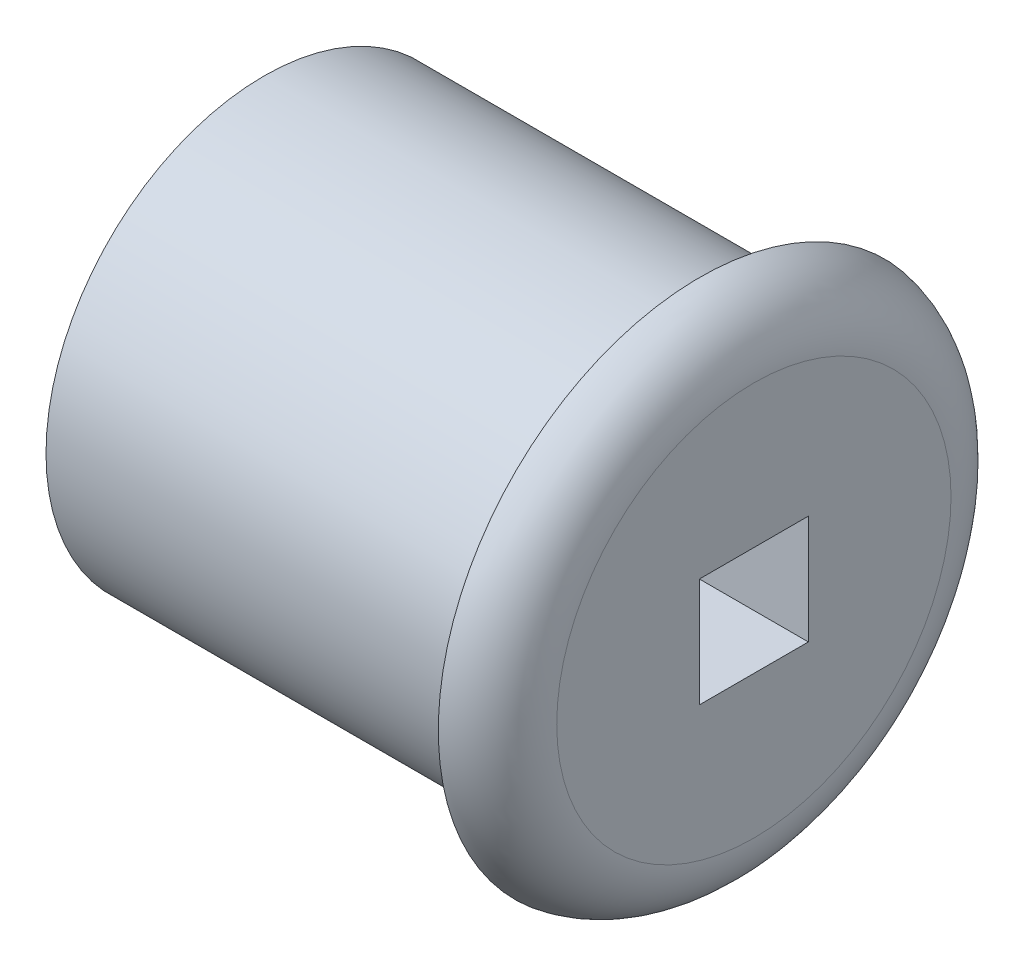
ISO-10303-21;
HEADER;
FILE_DESCRIPTION(('STEP AP214'),'2;1');
FILE_NAME('part.step','',(''),(''),'','','');
FILE_SCHEMA(('AUTOMOTIVE_DESIGN { 1 0 10303 214 1 1 1 1 }'));
ENDSEC;
DATA;
#1=APPLICATION_CONTEXT('core data for automotive mechanical design processes');
#2=APPLICATION_PROTOCOL_DEFINITION('international standard','automotive_design',2000,#1);
#3=PRODUCT_CONTEXT('',#1,'mechanical');
#4=PRODUCT('Part','Part','',(#3));
#5=PRODUCT_RELATED_PRODUCT_CATEGORY('part','',(#4));
#6=PRODUCT_DEFINITION_FORMATION('','',#4);
#7=PRODUCT_DEFINITION_CONTEXT('part definition',#1,'design');
#8=PRODUCT_DEFINITION('design','',#6,#7);
#9=PRODUCT_DEFINITION_SHAPE('','',#8);
#10=(LENGTH_UNIT() NAMED_UNIT(*) SI_UNIT(.MILLI.,.METRE.));
#11=(NAMED_UNIT(*) PLANE_ANGLE_UNIT() SI_UNIT($,.RADIAN.));
#12=(NAMED_UNIT(*) SI_UNIT($,.STERADIAN.) SOLID_ANGLE_UNIT());
#13=UNCERTAINTY_MEASURE_WITH_UNIT(LENGTH_MEASURE(1.E-05),#10,'distance_accuracy_value','');
#14=(GEOMETRIC_REPRESENTATION_CONTEXT(3) GLOBAL_UNCERTAINTY_ASSIGNED_CONTEXT((#13)) GLOBAL_UNIT_ASSIGNED_CONTEXT((#10,
#11,#12)) REPRESENTATION_CONTEXT('',''));
#15=CARTESIAN_POINT('',(0.,0.,0.));
#16=DIRECTION('',(0.,0.,1.));
#17=DIRECTION('',(1.,0.,0.));
#18=AXIS2_PLACEMENT_3D('',#15,#16,#17);
#19=CARTESIAN_POINT('',(25.4,0.,0.));
#20=DIRECTION('',(-1.,0.,0.));
#21=DIRECTION('',(0.,0.,1.));
#22=AXIS2_PLACEMENT_3D('',#19,#20,#21);
#23=CYLINDRICAL_SURFACE('',#22,12.7);
#24=CARTESIAN_POINT('',(25.4,0.,0.));
#25=DIRECTION('',(1.,0.,0.));
#26=DIRECTION('',(0.,0.,-1.));
#27=AXIS2_PLACEMENT_3D('',#24,#25,#26);
#28=CIRCLE('',#27,12.7);
#29=CARTESIAN_POINT('',(25.4,0.,-12.7));
#30=VERTEX_POINT('',#29);
#31=EDGE_CURVE('E42',#30,#30,#28,.T.);
#32=ORIENTED_EDGE('',*,*,#31,.F.);
#33=EDGE_LOOP('',(#32));
#34=FACE_BOUND('',#33,.T.);
#35=CARTESIAN_POINT('',(0.,0.,0.));
#36=DIRECTION('',(1.,0.,0.));
#37=DIRECTION('',(0.,0.,-1.));
#38=AXIS2_PLACEMENT_3D('',#35,#36,#37);
#39=CIRCLE('',#38,12.7);
#40=CARTESIAN_POINT('',(0.,0.,-12.7));
#41=VERTEX_POINT('',#40);
#42=EDGE_CURVE('E115',#41,#41,#39,.T.);
#43=ORIENTED_EDGE('',*,*,#42,.T.);
#44=EDGE_LOOP('',(#43));
#45=FACE_BOUND('',#44,.T.);
#46=ADVANCED_FACE('F34',(#34,#45),#23,.T.);
#47=CARTESIAN_POINT('',(0.,0.,0.));
#48=DIRECTION('',(1.,0.,0.));
#49=DIRECTION('',(0.,0.,-1.));
#50=AXIS2_PLACEMENT_3D('',#47,#48,#49);
#51=PLANE('',#50);
#52=ORIENTED_EDGE('',*,*,#42,.F.);
#53=EDGE_LOOP('',(#52));
#54=FACE_BOUND('',#53,.T.);
#55=ADVANCED_FACE('F121',(#54),#51,.F.);
#56=CARTESIAN_POINT('',(25.4,0.,0.));
#57=DIRECTION('',(1.,0.,0.));
#58=DIRECTION('',(0.,0.,-1.));
#59=AXIS2_PLACEMENT_3D('',#56,#57,#58);
#60=PLANE('',#59);
#61=CARTESIAN_POINT('',(25.4,0.,0.));
#62=DIRECTION('',(1.,0.,0.));
#63=DIRECTION('',(0.,0.,-1.));
#64=AXIS2_PLACEMENT_3D('',#61,#62,#63);
#65=CIRCLE('',#64,15.24);
#66=CARTESIAN_POINT('',(25.4,0.,-15.24));
#67=VERTEX_POINT('',#66);
#68=EDGE_CURVE('E110',#67,#67,#65,.T.);
#69=ORIENTED_EDGE('',*,*,#68,.F.);
#70=EDGE_LOOP('',(#69));
#71=FACE_BOUND('',#70,.T.);
#72=ORIENTED_EDGE('',*,*,#31,.T.);
#73=EDGE_LOOP('',(#72));
#74=FACE_BOUND('',#73,.T.);
#75=ADVANCED_FACE('F123',(#71,#74),#60,.F.);
#76=CARTESIAN_POINT('',(28.5496,0.,0.));
#77=DIRECTION('',(1.,0.,0.));
#78=DIRECTION('',(0.,0.,-1.));
#79=AXIS2_PLACEMENT_3D('',#76,#77,#78);
#80=PLANE('',#79);
#81=DIRECTION('',(0.,1.,0.));
#82=VECTOR('',#81,1.);
#83=CARTESIAN_POINT('',(28.5496,-3.175,-3.175));
#84=LINE('',#83,#82);
#85=CARTESIAN_POINT('',(28.5496,-3.175,-3.175));
#86=VERTEX_POINT('',#85);
#87=CARTESIAN_POINT('',(28.5496,3.175,-3.175));
#88=VERTEX_POINT('',#87);
#89=EDGE_CURVE('E49',#86,#88,#84,.T.);
#90=ORIENTED_EDGE('',*,*,#89,.F.);
#91=DIRECTION('',(0.,0.,-1.));
#92=VECTOR('',#91,1.);
#93=CARTESIAN_POINT('',(28.5496,-3.175,3.175));
#94=LINE('',#93,#92);
#95=CARTESIAN_POINT('',(28.5496,-3.175,3.175));
#96=VERTEX_POINT('',#95);
#97=EDGE_CURVE('E100',#96,#86,#94,.T.);
#98=ORIENTED_EDGE('',*,*,#97,.F.);
#99=DIRECTION('',(0.,-1.,0.));
#100=VECTOR('',#99,1.);
#101=CARTESIAN_POINT('',(28.5496,-3.175,3.175));
#102=LINE('',#101,#100);
#103=CARTESIAN_POINT('',(28.5496,3.175,3.175));
#104=VERTEX_POINT('',#103);
#105=EDGE_CURVE('E106',#104,#96,#102,.T.);
#106=ORIENTED_EDGE('',*,*,#105,.F.);
#107=DIRECTION('',(0.,0.,1.));
#108=VECTOR('',#107,1.);
#109=CARTESIAN_POINT('',(28.5496,3.175,3.175));
#110=LINE('',#109,#108);
#111=EDGE_CURVE('E84',#88,#104,#110,.T.);
#112=ORIENTED_EDGE('',*,*,#111,.F.);
#113=EDGE_LOOP('',(#90,#98,#106,#112));
#114=FACE_BOUND('',#113,.T.);
#115=CARTESIAN_POINT('',(28.5496,0.,0.));
#116=DIRECTION('',(1.,0.,0.));
#117=DIRECTION('',(0.,0.,-1.));
#118=AXIS2_PLACEMENT_3D('',#115,#116,#117);
#119=CIRCLE('',#118,11.4876711444757);
#120=CARTESIAN_POINT('',(28.5496,0.,-11.4876711444757));
#121=VERTEX_POINT('',#120);
#122=EDGE_CURVE('E11',#121,#121,#119,.T.);
#123=ORIENTED_EDGE('',*,*,#122,.T.);
#124=EDGE_LOOP('',(#123));
#125=FACE_BOUND('',#124,.T.);
#126=ADVANCED_FACE('F129',(#114,#125),#80,.T.);
#127=CARTESIAN_POINT('',(24.7396,0.,0.));
#128=DIRECTION('',(-1.,0.,0.));
#129=DIRECTION('',(0.,0.,1.));
#130=AXIS2_PLACEMENT_3D('',#127,#128,#129);
#131=TOROIDAL_SURFACE('',#130,11.4876711444757,3.81);
#132=ORIENTED_EDGE('',*,*,#68,.T.);
#133=EDGE_LOOP('',(#132));
#134=FACE_BOUND('',#133,.T.);
#135=ORIENTED_EDGE('',*,*,#122,.F.);
#136=EDGE_LOOP('',(#135));
#137=FACE_BOUND('',#136,.T.);
#138=ADVANCED_FACE('F36',(#134,#137),#131,.T.);
#139=CARTESIAN_POINT('',(15.8496,-3.175,-3.175));
#140=DIRECTION('',(0.,0.,-1.));
#141=DIRECTION('',(-1.,0.,0.));
#142=AXIS2_PLACEMENT_3D('',#139,#140,#141);
#143=PLANE('',#142);
#144=ORIENTED_EDGE('',*,*,#89,.T.);
#145=DIRECTION('',(1.,0.,0.));
#146=VECTOR('',#145,1.);
#147=CARTESIAN_POINT('',(15.8496,3.175,-3.175));
#148=LINE('',#147,#146);
#149=CARTESIAN_POINT('',(15.8496,3.175,-3.175));
#150=VERTEX_POINT('',#149);
#151=EDGE_CURVE('E72',#150,#88,#148,.T.);
#152=ORIENTED_EDGE('',*,*,#151,.F.);
#153=DIRECTION('',(0.,1.,0.));
#154=VECTOR('',#153,1.);
#155=CARTESIAN_POINT('',(15.8496,-3.175,-3.175));
#156=LINE('',#155,#154);
#157=CARTESIAN_POINT('',(15.8496,-3.175,-3.175));
#158=VERTEX_POINT('',#157);
#159=EDGE_CURVE('E98',#158,#150,#156,.T.);
#160=ORIENTED_EDGE('',*,*,#159,.F.);
#161=DIRECTION('',(1.,0.,0.));
#162=VECTOR('',#161,1.);
#163=CARTESIAN_POINT('',(15.8496,-3.175,-3.175));
#164=LINE('',#163,#162);
#165=EDGE_CURVE('E57',#158,#86,#164,.T.);
#166=ORIENTED_EDGE('',*,*,#165,.T.);
#167=EDGE_LOOP('',(#144,#152,#160,#166));
#168=FACE_BOUND('',#167,.T.);
#169=ADVANCED_FACE('F137',(#168),#143,.F.);
#170=CARTESIAN_POINT('',(15.8496,-3.175,3.175));
#171=DIRECTION('',(0.,-1.,0.));
#172=DIRECTION('',(0.,0.,-1.));
#173=AXIS2_PLACEMENT_3D('',#170,#171,#172);
#174=PLANE('',#173);
#175=ORIENTED_EDGE('',*,*,#97,.T.);
#176=ORIENTED_EDGE('',*,*,#165,.F.);
#177=DIRECTION('',(0.,0.,-1.));
#178=VECTOR('',#177,1.);
#179=CARTESIAN_POINT('',(15.8496,-3.175,3.175));
#180=LINE('',#179,#178);
#181=CARTESIAN_POINT('',(15.8496,-3.175,3.175));
#182=VERTEX_POINT('',#181);
#183=EDGE_CURVE('E95',#182,#158,#180,.T.);
#184=ORIENTED_EDGE('',*,*,#183,.F.);
#185=DIRECTION('',(1.,0.,0.));
#186=VECTOR('',#185,1.);
#187=CARTESIAN_POINT('',(15.8496,-3.175,3.175));
#188=LINE('',#187,#186);
#189=EDGE_CURVE('E88',#182,#96,#188,.T.);
#190=ORIENTED_EDGE('',*,*,#189,.T.);
#191=EDGE_LOOP('',(#175,#176,#184,#190));
#192=FACE_BOUND('',#191,.T.);
#193=ADVANCED_FACE('F140',(#192),#174,.F.);
#194=CARTESIAN_POINT('',(15.8496,-3.175,3.175));
#195=DIRECTION('',(0.,0.,1.));
#196=DIRECTION('',(1.,0.,0.));
#197=AXIS2_PLACEMENT_3D('',#194,#195,#196);
#198=PLANE('',#197);
#199=ORIENTED_EDGE('',*,*,#105,.T.);
#200=ORIENTED_EDGE('',*,*,#189,.F.);
#201=DIRECTION('',(0.,-1.,0.));
#202=VECTOR('',#201,1.);
#203=CARTESIAN_POINT('',(15.8496,-3.175,3.175));
#204=LINE('',#203,#202);
#205=CARTESIAN_POINT('',(15.8496,3.175,3.175));
#206=VERTEX_POINT('',#205);
#207=EDGE_CURVE('E91',#206,#182,#204,.T.);
#208=ORIENTED_EDGE('',*,*,#207,.F.);
#209=DIRECTION('',(1.,0.,0.));
#210=VECTOR('',#209,1.);
#211=CARTESIAN_POINT('',(15.8496,3.175,3.175));
#212=LINE('',#211,#210);
#213=EDGE_CURVE('E77',#206,#104,#212,.T.);
#214=ORIENTED_EDGE('',*,*,#213,.T.);
#215=EDGE_LOOP('',(#199,#200,#208,#214));
#216=FACE_BOUND('',#215,.T.);
#217=ADVANCED_FACE('F92',(#216),#198,.F.);
#218=CARTESIAN_POINT('',(15.8496,3.175,3.175));
#219=DIRECTION('',(0.,1.,0.));
#220=DIRECTION('',(0.,0.,1.));
#221=AXIS2_PLACEMENT_3D('',#218,#219,#220);
#222=PLANE('',#221);
#223=ORIENTED_EDGE('',*,*,#111,.T.);
#224=ORIENTED_EDGE('',*,*,#213,.F.);
#225=DIRECTION('',(0.,0.,1.));
#226=VECTOR('',#225,1.);
#227=CARTESIAN_POINT('',(15.8496,3.175,3.175));
#228=LINE('',#227,#226);
#229=EDGE_CURVE('E81',#150,#206,#228,.T.);
#230=ORIENTED_EDGE('',*,*,#229,.F.);
#231=ORIENTED_EDGE('',*,*,#151,.T.);
#232=EDGE_LOOP('',(#223,#224,#230,#231));
#233=FACE_BOUND('',#232,.T.);
#234=ADVANCED_FACE('F79',(#233),#222,.F.);
#235=CARTESIAN_POINT('',(15.8496,0.,0.));
#236=DIRECTION('',(-1.,0.,0.));
#237=DIRECTION('',(0.,0.,1.));
#238=AXIS2_PLACEMENT_3D('',#235,#236,#237);
#239=PLANE('',#238);
#240=ORIENTED_EDGE('',*,*,#159,.T.);
#241=ORIENTED_EDGE('',*,*,#229,.T.);
#242=ORIENTED_EDGE('',*,*,#207,.T.);
#243=ORIENTED_EDGE('',*,*,#183,.T.);
#244=EDGE_LOOP('',(#240,#241,#242,#243));
#245=FACE_BOUND('',#244,.T.);
#246=ADVANCED_FACE('F97',(#245),#239,.F.);
#247=CLOSED_SHELL('',(#46,#55,#75,#126,#138,#169,#193,#217,#234,#246));
#248=MANIFOLD_SOLID_BREP('B2',#247);
#249=ADVANCED_BREP_SHAPE_REPRESENTATION('',(#18,#248),#14);
#250=SHAPE_DEFINITION_REPRESENTATION(#9,#249);
ENDSEC;
END-ISO-10303-21;
